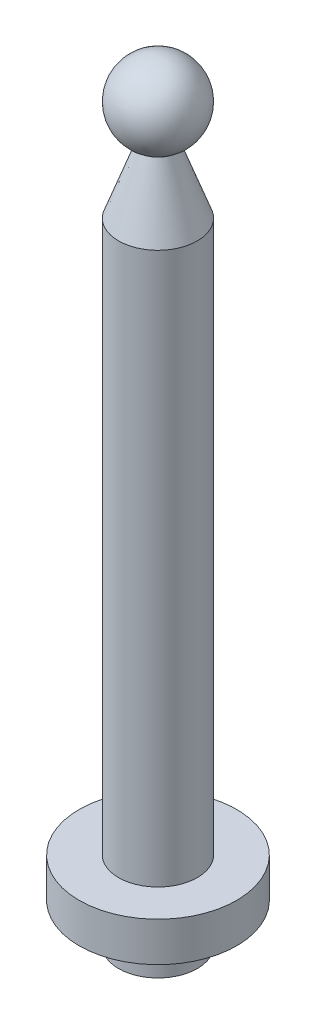
ISO-10303-21;
HEADER;
FILE_DESCRIPTION(('STEP AP214'),'2;1');
FILE_NAME('part.step','',(''),(''),'','','');
FILE_SCHEMA(('AUTOMOTIVE_DESIGN { 1 0 10303 214 1 1 1 1 }'));
ENDSEC;
DATA;
#1=APPLICATION_CONTEXT('core data for automotive mechanical design processes');
#2=APPLICATION_PROTOCOL_DEFINITION('international standard','automotive_design',2000,#1);
#3=PRODUCT_CONTEXT('',#1,'mechanical');
#4=PRODUCT('Part','Part','',(#3));
#5=PRODUCT_RELATED_PRODUCT_CATEGORY('part','',(#4));
#6=PRODUCT_DEFINITION_FORMATION('','',#4);
#7=PRODUCT_DEFINITION_CONTEXT('part definition',#1,'design');
#8=PRODUCT_DEFINITION('design','',#6,#7);
#9=PRODUCT_DEFINITION_SHAPE('','',#8);
#10=(LENGTH_UNIT() NAMED_UNIT(*) SI_UNIT(.MILLI.,.METRE.));
#11=(NAMED_UNIT(*) PLANE_ANGLE_UNIT() SI_UNIT($,.RADIAN.));
#12=(NAMED_UNIT(*) SI_UNIT($,.STERADIAN.) SOLID_ANGLE_UNIT());
#13=UNCERTAINTY_MEASURE_WITH_UNIT(LENGTH_MEASURE(1.E-05),#10,'distance_accuracy_value','');
#14=(GEOMETRIC_REPRESENTATION_CONTEXT(3) GLOBAL_UNCERTAINTY_ASSIGNED_CONTEXT((#13)) GLOBAL_UNIT_ASSIGNED_CONTEXT((#10,
#11,#12)) REPRESENTATION_CONTEXT('',''));
#15=CARTESIAN_POINT('',(0.,0.,0.));
#16=DIRECTION('',(0.,0.,1.));
#17=DIRECTION('',(1.,0.,0.));
#18=AXIS2_PLACEMENT_3D('',#15,#16,#17);
#19=CARTESIAN_POINT('',(0.,5.,0.));
#20=DIRECTION('',(0.,-1.,0.));
#21=DIRECTION('',(0.,0.,-1.));
#22=AXIS2_PLACEMENT_3D('',#19,#20,#21);
#23=CYLINDRICAL_SURFACE('',#22,5.);
#24=CARTESIAN_POINT('',(0.,5.,0.));
#25=DIRECTION('',(0.,1.,0.));
#26=DIRECTION('',(0.,0.,1.));
#27=AXIS2_PLACEMENT_3D('',#24,#25,#26);
#28=CIRCLE('',#27,5.);
#29=CARTESIAN_POINT('',(0.,5.,5.));
#30=VERTEX_POINT('',#29);
#31=EDGE_CURVE('E41',#30,#30,#28,.T.);
#32=ORIENTED_EDGE('',*,*,#31,.F.);
#33=EDGE_LOOP('',(#32));
#34=FACE_BOUND('',#33,.T.);
#35=CARTESIAN_POINT('',(0.,0.,0.));
#36=DIRECTION('',(0.,1.,0.));
#37=DIRECTION('',(0.,0.,1.));
#38=AXIS2_PLACEMENT_3D('',#35,#36,#37);
#39=CIRCLE('',#38,5.);
#40=CARTESIAN_POINT('',(0.,0.,5.));
#41=VERTEX_POINT('',#40);
#42=EDGE_CURVE('E37',#41,#41,#39,.T.);
#43=ORIENTED_EDGE('',*,*,#42,.T.);
#44=EDGE_LOOP('',(#43));
#45=FACE_BOUND('',#44,.T.);
#46=ADVANCED_FACE('F34',(#34,#45),#23,.T.);
#47=CARTESIAN_POINT('',(0.,0.,0.));
#48=DIRECTION('',(0.,1.,0.));
#49=DIRECTION('',(0.,0.,1.));
#50=AXIS2_PLACEMENT_3D('',#47,#48,#49);
#51=PLANE('',#50);
#52=ORIENTED_EDGE('',*,*,#42,.F.);
#53=EDGE_LOOP('',(#52));
#54=FACE_BOUND('',#53,.T.);
#55=ADVANCED_FACE('F81',(#54),#51,.F.);
#56=CARTESIAN_POINT('',(0.,10.,0.));
#57=DIRECTION('',(0.,-1.,0.));
#58=DIRECTION('',(0.,0.,-1.));
#59=AXIS2_PLACEMENT_3D('',#56,#57,#58);
#60=CYLINDRICAL_SURFACE('',#59,10.);
#61=CARTESIAN_POINT('',(0.,10.,0.));
#62=DIRECTION('',(0.,1.,0.));
#63=DIRECTION('',(0.,0.,1.));
#64=AXIS2_PLACEMENT_3D('',#61,#62,#63);
#65=CIRCLE('',#64,10.);
#66=CARTESIAN_POINT('',(0.,10.,10.));
#67=VERTEX_POINT('',#66);
#68=EDGE_CURVE('E50',#67,#67,#65,.T.);
#69=ORIENTED_EDGE('',*,*,#68,.F.);
#70=EDGE_LOOP('',(#69));
#71=FACE_BOUND('',#70,.T.);
#72=CARTESIAN_POINT('',(0.,5.,0.));
#73=DIRECTION('',(0.,1.,0.));
#74=DIRECTION('',(0.,0.,1.));
#75=AXIS2_PLACEMENT_3D('',#72,#73,#74);
#76=CIRCLE('',#75,10.);
#77=CARTESIAN_POINT('',(0.,5.,10.));
#78=VERTEX_POINT('',#77);
#79=EDGE_CURVE('E54',#78,#78,#76,.T.);
#80=ORIENTED_EDGE('',*,*,#79,.T.);
#81=EDGE_LOOP('',(#80));
#82=FACE_BOUND('',#81,.T.);
#83=ADVANCED_FACE('F86',(#71,#82),#60,.T.);
#84=CARTESIAN_POINT('',(0.,10.,0.));
#85=DIRECTION('',(0.,1.,0.));
#86=DIRECTION('',(0.,0.,1.));
#87=AXIS2_PLACEMENT_3D('',#84,#85,#86);
#88=PLANE('',#87);
#89=CARTESIAN_POINT('',(0.,10.,0.));
#90=DIRECTION('',(0.,1.,0.));
#91=DIRECTION('',(0.,0.,1.));
#92=AXIS2_PLACEMENT_3D('',#89,#90,#91);
#93=CIRCLE('',#92,5.);
#94=CARTESIAN_POINT('',(0.,10.,5.));
#95=VERTEX_POINT('',#94);
#96=EDGE_CURVE('E10',#95,#95,#93,.T.);
#97=ORIENTED_EDGE('',*,*,#96,.F.);
#98=EDGE_LOOP('',(#97));
#99=FACE_BOUND('',#98,.T.);
#100=ORIENTED_EDGE('',*,*,#68,.T.);
#101=EDGE_LOOP('',(#100));
#102=FACE_BOUND('',#101,.T.);
#103=ADVANCED_FACE('F95',(#99,#102),#88,.T.);
#104=CARTESIAN_POINT('',(0.,5.,0.));
#105=DIRECTION('',(0.,1.,0.));
#106=DIRECTION('',(0.,0.,1.));
#107=AXIS2_PLACEMENT_3D('',#104,#105,#106);
#108=PLANE('',#107);
#109=ORIENTED_EDGE('',*,*,#31,.T.);
#110=EDGE_LOOP('',(#109));
#111=FACE_BOUND('',#110,.T.);
#112=ORIENTED_EDGE('',*,*,#79,.F.);
#113=EDGE_LOOP('',(#112));
#114=FACE_BOUND('',#113,.T.);
#115=ADVANCED_FACE('F77',(#111,#114),#108,.F.);
#116=CARTESIAN_POINT('',(0.,80.,0.));
#117=DIRECTION('',(0.,-1.,0.));
#118=DIRECTION('',(0.,0.,-1.));
#119=AXIS2_PLACEMENT_3D('',#116,#117,#118);
#120=CYLINDRICAL_SURFACE('',#119,5.);
#121=CARTESIAN_POINT('',(0.,80.,0.));
#122=DIRECTION('',(0.,1.,0.));
#123=DIRECTION('',(0.,0.,1.));
#124=AXIS2_PLACEMENT_3D('',#121,#122,#123);
#125=CIRCLE('',#124,5.);
#126=CARTESIAN_POINT('',(0.,80.,5.));
#127=VERTEX_POINT('',#126);
#128=EDGE_CURVE('E48',#127,#127,#125,.T.);
#129=ORIENTED_EDGE('',*,*,#128,.F.);
#130=EDGE_LOOP('',(#129));
#131=FACE_BOUND('',#130,.T.);
#132=ORIENTED_EDGE('',*,*,#96,.T.);
#133=EDGE_LOOP('',(#132));
#134=FACE_BOUND('',#133,.T.);
#135=ADVANCED_FACE('F70',(#131,#134),#120,.T.);
#136=CARTESIAN_POINT('',(0.,80.,0.));
#137=DIRECTION('',(0.,-1.,0.));
#138=DIRECTION('',(0.,0.,-1.));
#139=AXIS2_PLACEMENT_3D('',#136,#137,#138);
#140=CONICAL_SURFACE('',#139,5.,0.34906585039887);
#141=CARTESIAN_POINT('',(0.,88.2424322583638,0.));
#142=DIRECTION('',(0.,1.,0.));
#143=DIRECTION('',(0.,0.,1.));
#144=AXIS2_PLACEMENT_3D('',#141,#142,#143);
#145=CIRCLE('',#144,2.);
#146=CARTESIAN_POINT('',(0.,88.2424322583638,2.));
#147=VERTEX_POINT('',#146);
#148=EDGE_CURVE('E60',#147,#147,#145,.T.);
#149=ORIENTED_EDGE('',*,*,#148,.F.);
#150=EDGE_LOOP('',(#149));
#151=FACE_BOUND('',#150,.T.);
#152=ORIENTED_EDGE('',*,*,#128,.T.);
#153=EDGE_LOOP('',(#152));
#154=FACE_BOUND('',#153,.T.);
#155=ADVANCED_FACE('F68',(#151,#154),#140,.T.);
#156=CARTESIAN_POINT('',(0.,92.8250079533196,0.));
#157=DIRECTION('',(0.,1.,0.));
#158=DIRECTION('',(0.,0.,-1.));
#159=AXIS2_PLACEMENT_3D('',#156,#157,#158);
#160=SPHERICAL_SURFACE('',#159,5.);
#161=ORIENTED_EDGE('',*,*,#148,.T.);
#162=EDGE_LOOP('',(#161));
#163=FACE_BOUND('',#162,.T.);
#164=ADVANCED_FACE('F66',(#163),#160,.T.);
#165=CLOSED_SHELL('',(#46,#55,#83,#103,#115,#135,#155,#164));
#166=MANIFOLD_SOLID_BREP('B2',#165);
#167=ADVANCED_BREP_SHAPE_REPRESENTATION('',(#18,#166),#14);
#168=SHAPE_DEFINITION_REPRESENTATION(#9,#167);
ENDSEC;
END-ISO-10303-21;
